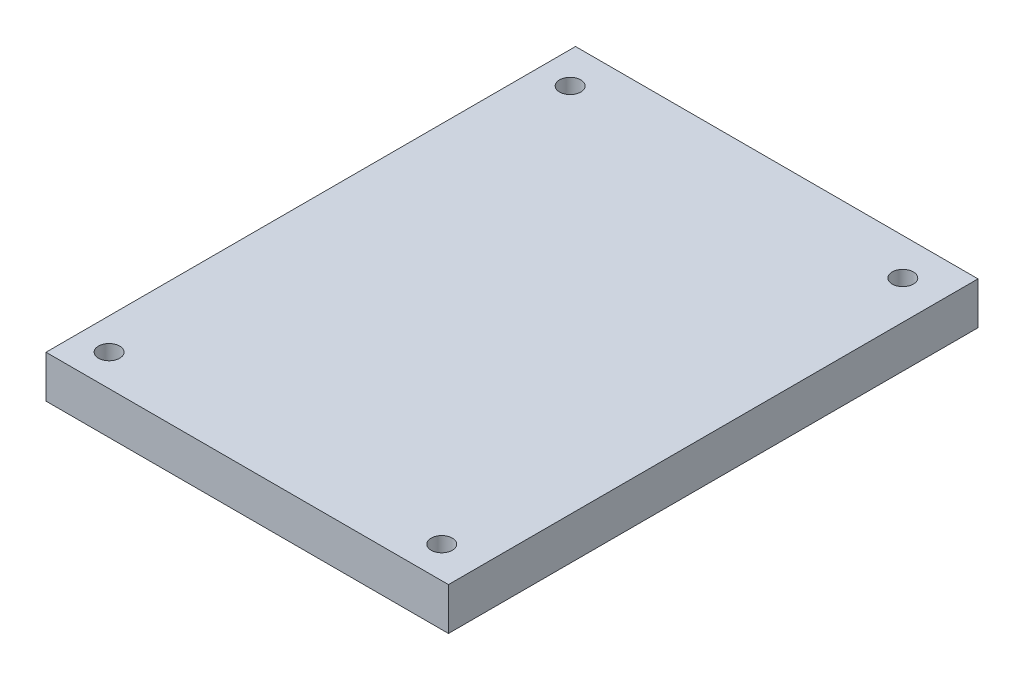
ISO-10303-21;
HEADER;
FILE_DESCRIPTION(('STEP AP214'),'2;1');
FILE_NAME('part.step','',(''),(''),'','','');
FILE_SCHEMA(('AUTOMOTIVE_DESIGN { 1 0 10303 214 1 1 1 1 }'));
ENDSEC;
DATA;
#1=APPLICATION_CONTEXT('core data for automotive mechanical design processes');
#2=APPLICATION_PROTOCOL_DEFINITION('international standard','automotive_design',2000,#1);
#3=PRODUCT_CONTEXT('',#1,'mechanical');
#4=PRODUCT('Part','Part','',(#3));
#5=PRODUCT_RELATED_PRODUCT_CATEGORY('part','',(#4));
#6=PRODUCT_DEFINITION_FORMATION('','',#4);
#7=PRODUCT_DEFINITION_CONTEXT('part definition',#1,'design');
#8=PRODUCT_DEFINITION('design','',#6,#7);
#9=PRODUCT_DEFINITION_SHAPE('','',#8);
#10=(LENGTH_UNIT() NAMED_UNIT(*) SI_UNIT(.MILLI.,.METRE.));
#11=(NAMED_UNIT(*) PLANE_ANGLE_UNIT() SI_UNIT($,.RADIAN.));
#12=(NAMED_UNIT(*) SI_UNIT($,.STERADIAN.) SOLID_ANGLE_UNIT());
#13=UNCERTAINTY_MEASURE_WITH_UNIT(LENGTH_MEASURE(1.E-05),#10,'distance_accuracy_value','');
#14=(GEOMETRIC_REPRESENTATION_CONTEXT(3) GLOBAL_UNCERTAINTY_ASSIGNED_CONTEXT((#13)) GLOBAL_UNIT_ASSIGNED_CONTEXT((#10,
#11,#12)) REPRESENTATION_CONTEXT('',''));
#15=CARTESIAN_POINT('',(0.,0.,0.));
#16=DIRECTION('',(0.,0.,1.));
#17=DIRECTION('',(1.,0.,0.));
#18=AXIS2_PLACEMENT_3D('',#15,#16,#17);
#19=CARTESIAN_POINT('',(0.,2.,0.));
#20=DIRECTION('',(0.,-1.,0.));
#21=DIRECTION('',(0.,0.,-1.));
#22=AXIS2_PLACEMENT_3D('',#19,#20,#21);
#23=PLANE('',#22);
#24=DIRECTION('',(0.,0.,1.));
#25=VECTOR('',#24,1.);
#26=CARTESIAN_POINT('',(-7.44680851063831,2.,9.64095744680851));
#27=LINE('',#26,#25);
#28=CARTESIAN_POINT('',(-7.44680851063831,2.,-15.3590425531915));
#29=VERTEX_POINT('',#28);
#30=CARTESIAN_POINT('',(-7.44680851063831,2.,9.64095744680851));
#31=VERTEX_POINT('',#30);
#32=EDGE_CURVE('E86',#29,#31,#27,.T.);
#33=ORIENTED_EDGE('',*,*,#32,.T.);
#34=DIRECTION('',(1.,0.,0.));
#35=VECTOR('',#34,1.);
#36=CARTESIAN_POINT('',(-7.44680851063831,2.,9.64095744680851));
#37=LINE('',#36,#35);
#38=CARTESIAN_POINT('',(11.5531914893617,2.,9.64095744680851));
#39=VERTEX_POINT('',#38);
#40=EDGE_CURVE('E81',#31,#39,#37,.T.);
#41=ORIENTED_EDGE('',*,*,#40,.T.);
#42=DIRECTION('',(0.,0.,-1.));
#43=VECTOR('',#42,1.);
#44=CARTESIAN_POINT('',(11.5531914893617,2.,9.64095744680851));
#45=LINE('',#44,#43);
#46=CARTESIAN_POINT('',(11.5531914893617,2.,-15.3590425531915));
#47=VERTEX_POINT('',#46);
#48=EDGE_CURVE('E84',#39,#47,#45,.T.);
#49=ORIENTED_EDGE('',*,*,#48,.T.);
#50=DIRECTION('',(-1.,0.,0.));
#51=VECTOR('',#50,1.);
#52=CARTESIAN_POINT('',(-7.44680851063831,2.,-15.3590425531915));
#53=LINE('',#52,#51);
#54=EDGE_CURVE('E51',#47,#29,#53,.T.);
#55=ORIENTED_EDGE('',*,*,#54,.T.);
#56=EDGE_LOOP('',(#33,#41,#49,#55));
#57=FACE_BOUND('',#56,.T.);
#58=CARTESIAN_POINT('',(-5.96076041709807,2.,-13.6190973964599));
#59=DIRECTION('',(0.,1.,0.));
#60=DIRECTION('',(0.,0.,1.));
#61=AXIS2_PLACEMENT_3D('',#58,#59,#60);
#62=CIRCLE('',#61,0.500000000000001);
#63=CARTESIAN_POINT('',(-5.96076041709807,2.,-13.1190973964599));
#64=VERTEX_POINT('',#63);
#65=EDGE_CURVE('E101',#64,#64,#62,.T.);
#66=ORIENTED_EDGE('',*,*,#65,.F.);
#67=EDGE_LOOP('',(#66));
#68=FACE_BOUND('',#67,.T.);
#69=CARTESIAN_POINT('',(9.74294447362292,2.,-13.6190973964599));
#70=DIRECTION('',(0.,1.,0.));
#71=DIRECTION('',(0.,0.,1.));
#72=AXIS2_PLACEMENT_3D('',#69,#70,#71);
#73=CIRCLE('',#72,0.500000000000001);
#74=CARTESIAN_POINT('',(9.74294447362292,2.,-13.1190973964599));
#75=VERTEX_POINT('',#74);
#76=EDGE_CURVE('E116',#75,#75,#73,.T.);
#77=ORIENTED_EDGE('',*,*,#76,.F.);
#78=EDGE_LOOP('',(#77));
#79=FACE_BOUND('',#78,.T.);
#80=CARTESIAN_POINT('',(-5.96076041709807,2.,8.14781401577496));
#81=DIRECTION('',(0.,1.,0.));
#82=DIRECTION('',(0.,0.,1.));
#83=AXIS2_PLACEMENT_3D('',#80,#81,#82);
#84=CIRCLE('',#83,0.500000000000001);
#85=CARTESIAN_POINT('',(-5.96076041709807,2.,8.64781401577497));
#86=VERTEX_POINT('',#85);
#87=EDGE_CURVE('E122',#86,#86,#84,.T.);
#88=ORIENTED_EDGE('',*,*,#87,.F.);
#89=EDGE_LOOP('',(#88));
#90=FACE_BOUND('',#89,.T.);
#91=CARTESIAN_POINT('',(9.74294447362292,2.,8.14781401577496));
#92=DIRECTION('',(0.,1.,0.));
#93=DIRECTION('',(0.,0.,1.));
#94=AXIS2_PLACEMENT_3D('',#91,#92,#93);
#95=CIRCLE('',#94,0.500000000000001);
#96=CARTESIAN_POINT('',(9.74294447362292,2.,8.64781401577497));
#97=VERTEX_POINT('',#96);
#98=EDGE_CURVE('E128',#97,#97,#95,.T.);
#99=ORIENTED_EDGE('',*,*,#98,.F.);
#100=EDGE_LOOP('',(#99));
#101=FACE_BOUND('',#100,.T.);
#102=ADVANCED_FACE('F34',(#57,#68,#79,#90,#101),#23,.F.);
#103=CARTESIAN_POINT('',(0.,0.,0.));
#104=DIRECTION('',(0.,-1.,0.));
#105=DIRECTION('',(0.,0.,-1.));
#106=AXIS2_PLACEMENT_3D('',#103,#104,#105);
#107=PLANE('',#106);
#108=CARTESIAN_POINT('',(-5.96076041709807,0.,8.14781401577496));
#109=DIRECTION('',(0.,1.,0.));
#110=DIRECTION('',(0.,0.,1.));
#111=AXIS2_PLACEMENT_3D('',#108,#109,#110);
#112=CIRCLE('',#111,0.500000000000001);
#113=CARTESIAN_POINT('',(-5.96076041709807,0.,8.64781401577497));
#114=VERTEX_POINT('',#113);
#115=EDGE_CURVE('E125',#114,#114,#112,.T.);
#116=ORIENTED_EDGE('',*,*,#115,.T.);
#117=EDGE_LOOP('',(#116));
#118=FACE_BOUND('',#117,.T.);
#119=CARTESIAN_POINT('',(-5.96076041709807,0.,-13.6190973964599));
#120=DIRECTION('',(0.,1.,0.));
#121=DIRECTION('',(0.,0.,1.));
#122=AXIS2_PLACEMENT_3D('',#119,#120,#121);
#123=CIRCLE('',#122,0.500000000000001);
#124=CARTESIAN_POINT('',(-5.96076041709807,0.,-13.1190973964599));
#125=VERTEX_POINT('',#124);
#126=EDGE_CURVE('E113',#125,#125,#123,.T.);
#127=ORIENTED_EDGE('',*,*,#126,.T.);
#128=EDGE_LOOP('',(#127));
#129=FACE_BOUND('',#128,.T.);
#130=DIRECTION('',(0.,0.,1.));
#131=VECTOR('',#130,1.);
#132=CARTESIAN_POINT('',(-7.44680851063831,0.,9.64095744680851));
#133=LINE('',#132,#131);
#134=CARTESIAN_POINT('',(-7.44680851063831,0.,-15.3590425531915));
#135=VERTEX_POINT('',#134);
#136=CARTESIAN_POINT('',(-7.44680851063831,0.,9.64095744680851));
#137=VERTEX_POINT('',#136);
#138=EDGE_CURVE('E98',#135,#137,#133,.T.);
#139=ORIENTED_EDGE('',*,*,#138,.F.);
#140=DIRECTION('',(-1.,0.,0.));
#141=VECTOR('',#140,1.);
#142=CARTESIAN_POINT('',(-7.44680851063831,0.,-15.3590425531915));
#143=LINE('',#142,#141);
#144=CARTESIAN_POINT('',(11.5531914893617,0.,-15.3590425531915));
#145=VERTEX_POINT('',#144);
#146=EDGE_CURVE('E74',#145,#135,#143,.T.);
#147=ORIENTED_EDGE('',*,*,#146,.F.);
#148=DIRECTION('',(0.,0.,-1.));
#149=VECTOR('',#148,1.);
#150=CARTESIAN_POINT('',(11.5531914893617,0.,9.64095744680851));
#151=LINE('',#150,#149);
#152=CARTESIAN_POINT('',(11.5531914893617,0.,9.64095744680851));
#153=VERTEX_POINT('',#152);
#154=EDGE_CURVE('E68',#153,#145,#151,.T.);
#155=ORIENTED_EDGE('',*,*,#154,.F.);
#156=DIRECTION('',(1.,0.,0.));
#157=VECTOR('',#156,1.);
#158=CARTESIAN_POINT('',(-7.44680851063831,0.,9.64095744680851));
#159=LINE('',#158,#157);
#160=EDGE_CURVE('E90',#137,#153,#159,.T.);
#161=ORIENTED_EDGE('',*,*,#160,.F.);
#162=EDGE_LOOP('',(#139,#147,#155,#161));
#163=FACE_BOUND('',#162,.T.);
#164=CARTESIAN_POINT('',(9.74294447362292,0.,-13.6190973964599));
#165=DIRECTION('',(0.,1.,0.));
#166=DIRECTION('',(0.,0.,1.));
#167=AXIS2_PLACEMENT_3D('',#164,#165,#166);
#168=CIRCLE('',#167,0.500000000000001);
#169=CARTESIAN_POINT('',(9.74294447362292,0.,-13.1190973964599));
#170=VERTEX_POINT('',#169);
#171=EDGE_CURVE('E119',#170,#170,#168,.T.);
#172=ORIENTED_EDGE('',*,*,#171,.T.);
#173=EDGE_LOOP('',(#172));
#174=FACE_BOUND('',#173,.T.);
#175=CARTESIAN_POINT('',(9.74294447362292,0.,8.14781401577496));
#176=DIRECTION('',(0.,1.,0.));
#177=DIRECTION('',(0.,0.,1.));
#178=AXIS2_PLACEMENT_3D('',#175,#176,#177);
#179=CIRCLE('',#178,0.500000000000001);
#180=CARTESIAN_POINT('',(9.74294447362292,0.,8.64781401577497));
#181=VERTEX_POINT('',#180);
#182=EDGE_CURVE('E131',#181,#181,#179,.T.);
#183=ORIENTED_EDGE('',*,*,#182,.T.);
#184=EDGE_LOOP('',(#183));
#185=FACE_BOUND('',#184,.T.);
#186=ADVANCED_FACE('F109',(#118,#129,#163,#174,#185),#107,.T.);
#187=CARTESIAN_POINT('',(-7.44680851063831,2.,9.64095744680851));
#188=DIRECTION('',(1.,0.,0.));
#189=DIRECTION('',(0.,0.,-1.));
#190=AXIS2_PLACEMENT_3D('',#187,#188,#189);
#191=PLANE('',#190);
#192=ORIENTED_EDGE('',*,*,#138,.T.);
#193=DIRECTION('',(0.,-1.,0.));
#194=VECTOR('',#193,1.);
#195=CARTESIAN_POINT('',(-7.44680851063831,2.,9.64095744680851));
#196=LINE('',#195,#194);
#197=EDGE_CURVE('E11',#31,#137,#196,.T.);
#198=ORIENTED_EDGE('',*,*,#197,.F.);
#199=ORIENTED_EDGE('',*,*,#32,.F.);
#200=DIRECTION('',(0.,-1.,0.));
#201=VECTOR('',#200,1.);
#202=CARTESIAN_POINT('',(-7.44680851063831,2.,-15.3590425531915));
#203=LINE('',#202,#201);
#204=EDGE_CURVE('E94',#29,#135,#203,.T.);
#205=ORIENTED_EDGE('',*,*,#204,.T.);
#206=EDGE_LOOP('',(#192,#198,#199,#205));
#207=FACE_BOUND('',#206,.T.);
#208=ADVANCED_FACE('F36',(#207),#191,.F.);
#209=CARTESIAN_POINT('',(-7.44680851063831,2.,9.64095744680851));
#210=DIRECTION('',(0.,0.,-1.));
#211=DIRECTION('',(-1.,0.,0.));
#212=AXIS2_PLACEMENT_3D('',#209,#210,#211);
#213=PLANE('',#212);
#214=ORIENTED_EDGE('',*,*,#160,.T.);
#215=DIRECTION('',(0.,-1.,0.));
#216=VECTOR('',#215,1.);
#217=CARTESIAN_POINT('',(11.5531914893617,2.,9.64095744680851));
#218=LINE('',#217,#216);
#219=EDGE_CURVE('E43',#39,#153,#218,.T.);
#220=ORIENTED_EDGE('',*,*,#219,.F.);
#221=ORIENTED_EDGE('',*,*,#40,.F.);
#222=ORIENTED_EDGE('',*,*,#197,.T.);
#223=EDGE_LOOP('',(#214,#220,#221,#222));
#224=FACE_BOUND('',#223,.T.);
#225=ADVANCED_FACE('F89',(#224),#213,.F.);
#226=CARTESIAN_POINT('',(11.5531914893617,2.,9.64095744680851));
#227=DIRECTION('',(-1.,0.,0.));
#228=DIRECTION('',(0.,0.,1.));
#229=AXIS2_PLACEMENT_3D('',#226,#227,#228);
#230=PLANE('',#229);
#231=ORIENTED_EDGE('',*,*,#154,.T.);
#232=DIRECTION('',(0.,-1.,0.));
#233=VECTOR('',#232,1.);
#234=CARTESIAN_POINT('',(11.5531914893617,2.,-15.3590425531915));
#235=LINE('',#234,#233);
#236=EDGE_CURVE('E91',#47,#145,#235,.T.);
#237=ORIENTED_EDGE('',*,*,#236,.F.);
#238=ORIENTED_EDGE('',*,*,#48,.F.);
#239=ORIENTED_EDGE('',*,*,#219,.T.);
#240=EDGE_LOOP('',(#231,#237,#238,#239));
#241=FACE_BOUND('',#240,.T.);
#242=ADVANCED_FACE('F92',(#241),#230,.F.);
#243=CARTESIAN_POINT('',(-7.44680851063831,2.,-15.3590425531915));
#244=DIRECTION('',(0.,0.,1.));
#245=DIRECTION('',(1.,0.,0.));
#246=AXIS2_PLACEMENT_3D('',#243,#244,#245);
#247=PLANE('',#246);
#248=ORIENTED_EDGE('',*,*,#146,.T.);
#249=ORIENTED_EDGE('',*,*,#204,.F.);
#250=ORIENTED_EDGE('',*,*,#54,.F.);
#251=ORIENTED_EDGE('',*,*,#236,.T.);
#252=EDGE_LOOP('',(#248,#249,#250,#251));
#253=FACE_BOUND('',#252,.T.);
#254=ADVANCED_FACE('F106',(#253),#247,.F.);
#255=CARTESIAN_POINT('',(-5.96076041709807,2.,-13.6190973964599));
#256=DIRECTION('',(0.,-1.,0.));
#257=DIRECTION('',(0.,0.,-1.));
#258=AXIS2_PLACEMENT_3D('',#255,#256,#257);
#259=CYLINDRICAL_SURFACE('',#258,0.500000000000001);
#260=ORIENTED_EDGE('',*,*,#65,.T.);
#261=EDGE_LOOP('',(#260));
#262=FACE_BOUND('',#261,.T.);
#263=ORIENTED_EDGE('',*,*,#126,.F.);
#264=EDGE_LOOP('',(#263));
#265=FACE_BOUND('',#264,.T.);
#266=ADVANCED_FACE('F148',(#262,#265),#259,.F.);
#267=CARTESIAN_POINT('',(9.74294447362292,2.,-13.6190973964599));
#268=DIRECTION('',(0.,-1.,0.));
#269=DIRECTION('',(0.,0.,-1.));
#270=AXIS2_PLACEMENT_3D('',#267,#268,#269);
#271=CYLINDRICAL_SURFACE('',#270,0.500000000000001);
#272=ORIENTED_EDGE('',*,*,#76,.T.);
#273=EDGE_LOOP('',(#272));
#274=FACE_BOUND('',#273,.T.);
#275=ORIENTED_EDGE('',*,*,#171,.F.);
#276=EDGE_LOOP('',(#275));
#277=FACE_BOUND('',#276,.T.);
#278=ADVANCED_FACE('F194',(#274,#277),#271,.F.);
#279=CARTESIAN_POINT('',(-5.96076041709807,2.,8.14781401577496));
#280=DIRECTION('',(0.,-1.,0.));
#281=DIRECTION('',(0.,0.,-1.));
#282=AXIS2_PLACEMENT_3D('',#279,#280,#281);
#283=CYLINDRICAL_SURFACE('',#282,0.500000000000001);
#284=ORIENTED_EDGE('',*,*,#87,.T.);
#285=EDGE_LOOP('',(#284));
#286=FACE_BOUND('',#285,.T.);
#287=ORIENTED_EDGE('',*,*,#115,.F.);
#288=EDGE_LOOP('',(#287));
#289=FACE_BOUND('',#288,.T.);
#290=ADVANCED_FACE('F202',(#286,#289),#283,.F.);
#291=CARTESIAN_POINT('',(9.74294447362292,2.,8.14781401577496));
#292=DIRECTION('',(0.,-1.,0.));
#293=DIRECTION('',(0.,0.,-1.));
#294=AXIS2_PLACEMENT_3D('',#291,#292,#293);
#295=CYLINDRICAL_SURFACE('',#294,0.500000000000001);
#296=ORIENTED_EDGE('',*,*,#98,.T.);
#297=EDGE_LOOP('',(#296));
#298=FACE_BOUND('',#297,.T.);
#299=ORIENTED_EDGE('',*,*,#182,.F.);
#300=EDGE_LOOP('',(#299));
#301=FACE_BOUND('',#300,.T.);
#302=ADVANCED_FACE('F137',(#298,#301),#295,.F.);
#303=CLOSED_SHELL('',(#102,#186,#208,#225,#242,#254,#266,#278,#290,#302));
#304=MANIFOLD_SOLID_BREP('B2',#303);
#305=ADVANCED_BREP_SHAPE_REPRESENTATION('',(#18,#304),#14);
#306=SHAPE_DEFINITION_REPRESENTATION(#9,#305);
ENDSEC;
END-ISO-10303-21;
